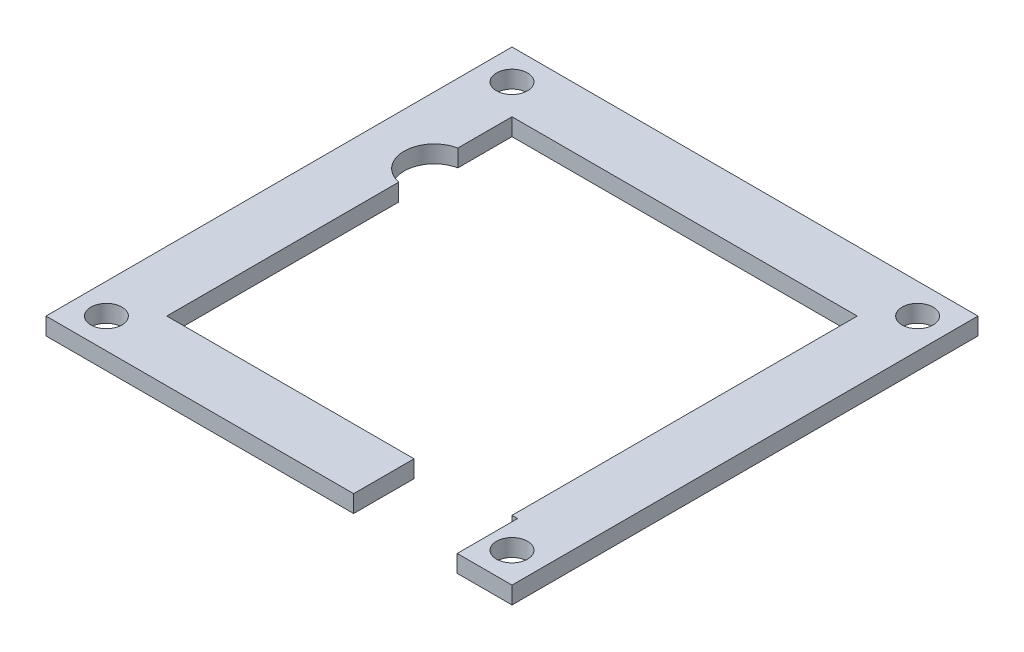
ISO-10303-21;
HEADER;
FILE_DESCRIPTION(('STEP AP214'),'2;1');
FILE_NAME('part.step','',(''),(''),'','','');
FILE_SCHEMA(('AUTOMOTIVE_DESIGN { 1 0 10303 214 1 1 1 1 }'));
ENDSEC;
DATA;
#1=APPLICATION_CONTEXT('core data for automotive mechanical design processes');
#2=APPLICATION_PROTOCOL_DEFINITION('international standard','automotive_design',2000,#1);
#3=PRODUCT_CONTEXT('',#1,'mechanical');
#4=PRODUCT('Part','Part','',(#3));
#5=PRODUCT_RELATED_PRODUCT_CATEGORY('part','',(#4));
#6=PRODUCT_DEFINITION_FORMATION('','',#4);
#7=PRODUCT_DEFINITION_CONTEXT('part definition',#1,'design');
#8=PRODUCT_DEFINITION('design','',#6,#7);
#9=PRODUCT_DEFINITION_SHAPE('','',#8);
#10=(LENGTH_UNIT() NAMED_UNIT(*) SI_UNIT(.MILLI.,.METRE.));
#11=(NAMED_UNIT(*) PLANE_ANGLE_UNIT() SI_UNIT($,.RADIAN.));
#12=(NAMED_UNIT(*) SI_UNIT($,.STERADIAN.) SOLID_ANGLE_UNIT());
#13=UNCERTAINTY_MEASURE_WITH_UNIT(LENGTH_MEASURE(1.E-05),#10,'distance_accuracy_value','');
#14=(GEOMETRIC_REPRESENTATION_CONTEXT(3) GLOBAL_UNCERTAINTY_ASSIGNED_CONTEXT((#13)) GLOBAL_UNIT_ASSIGNED_CONTEXT((#10,
#11,#12)) REPRESENTATION_CONTEXT('',''));
#15=CARTESIAN_POINT('',(0.,0.,0.));
#16=DIRECTION('',(0.,0.,1.));
#17=DIRECTION('',(1.,0.,0.));
#18=AXIS2_PLACEMENT_3D('',#15,#16,#17);
#19=CARTESIAN_POINT('',(-19.3,2.,-10.3));
#20=DIRECTION('',(0.,-1.,0.));
#21=DIRECTION('',(0.,0.,-1.));
#22=AXIS2_PLACEMENT_3D('',#19,#20,#21);
#23=CYLINDRICAL_SURFACE('',#22,3.5);
#24=CARTESIAN_POINT('',(-19.3,0.,-10.3));
#25=DIRECTION('',(0.,1.,0.));
#26=DIRECTION('',(0.,0.,1.));
#27=AXIS2_PLACEMENT_3D('',#24,#25,#26);
#28=CIRCLE('',#27,3.5);
#29=CARTESIAN_POINT('',(-20.,0.,-13.7292856398964));
#30=VERTEX_POINT('',#29);
#31=CARTESIAN_POINT('',(-20.,0.,-6.87071436010355));
#32=VERTEX_POINT('',#31);
#33=EDGE_CURVE('E177',#30,#32,#28,.T.);
#34=ORIENTED_EDGE('',*,*,#33,.F.);
#35=DIRECTION('',(0.,-1.,0.));
#36=VECTOR('',#35,1.);
#37=CARTESIAN_POINT('',(-20.,2.,-13.7292856398964));
#38=LINE('',#37,#36);
#39=CARTESIAN_POINT('',(-20.,2.,-13.7292856398964));
#40=VERTEX_POINT('',#39);
#41=EDGE_CURVE('E11',#40,#30,#38,.T.);
#42=ORIENTED_EDGE('',*,*,#41,.F.);
#43=CARTESIAN_POINT('',(-19.3,2.,-10.3));
#44=DIRECTION('',(0.,1.,0.));
#45=DIRECTION('',(0.,0.,1.));
#46=AXIS2_PLACEMENT_3D('',#43,#44,#45);
#47=CIRCLE('',#46,3.5);
#48=CARTESIAN_POINT('',(-20.,2.,-6.87071436010355));
#49=VERTEX_POINT('',#48);
#50=EDGE_CURVE('E218',#40,#49,#47,.T.);
#51=ORIENTED_EDGE('',*,*,#50,.T.);
#52=DIRECTION('',(0.,-1.,0.));
#53=VECTOR('',#52,1.);
#54=CARTESIAN_POINT('',(-20.,2.,-6.87071436010355));
#55=LINE('',#54,#53);
#56=EDGE_CURVE('E51',#49,#32,#55,.T.);
#57=ORIENTED_EDGE('',*,*,#56,.T.);
#58=EDGE_LOOP('',(#34,#42,#51,#57));
#59=FACE_BOUND('',#58,.T.);
#60=ADVANCED_FACE('F35',(#59),#23,.F.);
#61=CARTESIAN_POINT('',(-20.,2.,0.));
#62=DIRECTION('',(1.,0.,0.));
#63=DIRECTION('',(0.,0.,-1.));
#64=AXIS2_PLACEMENT_3D('',#61,#62,#63);
#65=PLANE('',#64);
#66=DIRECTION('',(0.,0.,1.));
#67=VECTOR('',#66,1.);
#68=CARTESIAN_POINT('',(-20.,0.,0.));
#69=LINE('',#68,#67);
#70=CARTESIAN_POINT('',(-20.,0.,-20.));
#71=VERTEX_POINT('',#70);
#72=EDGE_CURVE('E179',#71,#30,#69,.T.);
#73=ORIENTED_EDGE('',*,*,#72,.F.);
#74=DIRECTION('',(0.,-1.,0.));
#75=VECTOR('',#74,1.);
#76=CARTESIAN_POINT('',(-20.,2.,-20.));
#77=LINE('',#76,#75);
#78=CARTESIAN_POINT('',(-20.,2.,-20.));
#79=VERTEX_POINT('',#78);
#80=EDGE_CURVE('E43',#79,#71,#77,.T.);
#81=ORIENTED_EDGE('',*,*,#80,.F.);
#82=DIRECTION('',(0.,0.,1.));
#83=VECTOR('',#82,1.);
#84=CARTESIAN_POINT('',(-20.,2.,0.));
#85=LINE('',#84,#83);
#86=EDGE_CURVE('E163',#79,#40,#85,.T.);
#87=ORIENTED_EDGE('',*,*,#86,.T.);
#88=ORIENTED_EDGE('',*,*,#41,.T.);
#89=EDGE_LOOP('',(#73,#81,#87,#88));
#90=FACE_BOUND('',#89,.T.);
#91=ADVANCED_FACE('F256',(#90),#65,.T.);
#92=CARTESIAN_POINT('',(0.,2.,-20.));
#93=DIRECTION('',(0.,0.,-1.));
#94=DIRECTION('',(-1.,0.,0.));
#95=AXIS2_PLACEMENT_3D('',#92,#93,#94);
#96=PLANE('',#95);
#97=DIRECTION('',(1.,0.,0.));
#98=VECTOR('',#97,1.);
#99=CARTESIAN_POINT('',(0.,0.,-20.));
#100=LINE('',#99,#98);
#101=CARTESIAN_POINT('',(20.,0.,-20.));
#102=VERTEX_POINT('',#101);
#103=EDGE_CURVE('E182',#71,#102,#100,.T.);
#104=ORIENTED_EDGE('',*,*,#103,.T.);
#105=DIRECTION('',(0.,-1.,0.));
#106=VECTOR('',#105,1.);
#107=CARTESIAN_POINT('',(20.,2.,-20.));
#108=LINE('',#107,#106);
#109=CARTESIAN_POINT('',(20.,2.,-20.));
#110=VERTEX_POINT('',#109);
#111=EDGE_CURVE('E241',#110,#102,#108,.T.);
#112=ORIENTED_EDGE('',*,*,#111,.F.);
#113=DIRECTION('',(1.,0.,0.));
#114=VECTOR('',#113,1.);
#115=CARTESIAN_POINT('',(0.,2.,-20.));
#116=LINE('',#115,#114);
#117=EDGE_CURVE('E247',#79,#110,#116,.T.);
#118=ORIENTED_EDGE('',*,*,#117,.F.);
#119=ORIENTED_EDGE('',*,*,#80,.T.);
#120=EDGE_LOOP('',(#104,#112,#118,#119));
#121=FACE_BOUND('',#120,.T.);
#122=ADVANCED_FACE('F245',(#121),#96,.F.);
#123=CARTESIAN_POINT('',(20.,2.,0.));
#124=DIRECTION('',(-1.,0.,0.));
#125=DIRECTION('',(0.,0.,1.));
#126=AXIS2_PLACEMENT_3D('',#123,#124,#125);
#127=PLANE('',#126);
#128=DIRECTION('',(0.,0.,-1.));
#129=VECTOR('',#128,1.);
#130=CARTESIAN_POINT('',(20.,0.,0.));
#131=LINE('',#130,#129);
#132=CARTESIAN_POINT('',(20.,0.,20.));
#133=VERTEX_POINT('',#132);
#134=EDGE_CURVE('E186',#133,#102,#131,.T.);
#135=ORIENTED_EDGE('',*,*,#134,.F.);
#136=DIRECTION('',(0.,-1.,0.));
#137=VECTOR('',#136,1.);
#138=CARTESIAN_POINT('',(20.,2.,20.));
#139=LINE('',#138,#137);
#140=CARTESIAN_POINT('',(20.,2.,20.));
#141=VERTEX_POINT('',#140);
#142=EDGE_CURVE('E239',#141,#133,#139,.T.);
#143=ORIENTED_EDGE('',*,*,#142,.F.);
#144=DIRECTION('',(0.,0.,-1.));
#145=VECTOR('',#144,1.);
#146=CARTESIAN_POINT('',(20.,2.,0.));
#147=LINE('',#146,#145);
#148=EDGE_CURVE('E494',#141,#110,#147,.T.);
#149=ORIENTED_EDGE('',*,*,#148,.T.);
#150=ORIENTED_EDGE('',*,*,#111,.T.);
#151=EDGE_LOOP('',(#135,#143,#149,#150));
#152=FACE_BOUND('',#151,.T.);
#153=ADVANCED_FACE('F287',(#152),#127,.T.);
#154=CARTESIAN_POINT('',(2.13504427812533E-13,2.,20.0000000000002));
#155=DIRECTION('',(0.,0.,1.));
#156=DIRECTION('',(1.,0.,0.));
#157=AXIS2_PLACEMENT_3D('',#154,#155,#156);
#158=PLANE('',#157);
#159=DIRECTION('',(-1.,0.,0.));
#160=VECTOR('',#159,1.);
#161=CARTESIAN_POINT('',(2.13504427812533E-13,0.,20.0000000000002));
#162=LINE('',#161,#160);
#163=CARTESIAN_POINT('',(20.65,0.,20.));
#164=VERTEX_POINT('',#163);
#165=EDGE_CURVE('E189',#164,#133,#162,.T.);
#166=ORIENTED_EDGE('',*,*,#165,.F.);
#167=DIRECTION('',(0.,-1.,0.));
#168=VECTOR('',#167,1.);
#169=CARTESIAN_POINT('',(20.65,2.,20.));
#170=LINE('',#169,#168);
#171=CARTESIAN_POINT('',(20.65,2.,20.));
#172=VERTEX_POINT('',#171);
#173=EDGE_CURVE('E237',#172,#164,#170,.T.);
#174=ORIENTED_EDGE('',*,*,#173,.F.);
#175=DIRECTION('',(-1.,0.,0.));
#176=VECTOR('',#175,1.);
#177=CARTESIAN_POINT('',(2.13504427812533E-13,2.,20.0000000000002));
#178=LINE('',#177,#176);
#179=EDGE_CURVE('E491',#172,#141,#178,.T.);
#180=ORIENTED_EDGE('',*,*,#179,.T.);
#181=ORIENTED_EDGE('',*,*,#142,.T.);
#182=EDGE_LOOP('',(#166,#174,#180,#181));
#183=FACE_BOUND('',#182,.T.);
#184=ADVANCED_FACE('F293',(#183),#158,.T.);
#185=CARTESIAN_POINT('',(20.65,2.,0.));
#186=DIRECTION('',(1.,0.,0.));
#187=DIRECTION('',(0.,0.,-1.));
#188=AXIS2_PLACEMENT_3D('',#185,#186,#187);
#189=PLANE('',#188);
#190=DIRECTION('',(0.,0.,1.));
#191=VECTOR('',#190,1.);
#192=CARTESIAN_POINT('',(20.65,0.,0.));
#193=LINE('',#192,#191);
#194=CARTESIAN_POINT('',(20.65,0.,27.));
#195=VERTEX_POINT('',#194);
#196=EDGE_CURVE('E192',#164,#195,#193,.T.);
#197=ORIENTED_EDGE('',*,*,#196,.T.);
#198=DIRECTION('',(0.,-1.,0.));
#199=VECTOR('',#198,1.);
#200=CARTESIAN_POINT('',(20.65,2.,27.));
#201=LINE('',#200,#199);
#202=CARTESIAN_POINT('',(20.65,2.,27.));
#203=VERTEX_POINT('',#202);
#204=EDGE_CURVE('E234',#203,#195,#201,.T.);
#205=ORIENTED_EDGE('',*,*,#204,.F.);
#206=DIRECTION('',(0.,0.,1.));
#207=VECTOR('',#206,1.);
#208=CARTESIAN_POINT('',(20.65,2.,0.));
#209=LINE('',#208,#207);
#210=EDGE_CURVE('E488',#172,#203,#209,.T.);
#211=ORIENTED_EDGE('',*,*,#210,.F.);
#212=ORIENTED_EDGE('',*,*,#173,.T.);
#213=EDGE_LOOP('',(#197,#205,#211,#212));
#214=FACE_BOUND('',#213,.T.);
#215=ADVANCED_FACE('F301',(#214),#189,.F.);
#216=CARTESIAN_POINT('',(0.,2.,27.));
#217=DIRECTION('',(0.,0.,-1.));
#218=DIRECTION('',(-1.,0.,0.));
#219=AXIS2_PLACEMENT_3D('',#216,#217,#218);
#220=PLANE('',#219);
#221=DIRECTION('',(1.,0.,0.));
#222=VECTOR('',#221,1.);
#223=CARTESIAN_POINT('',(0.,0.,27.));
#224=LINE('',#223,#222);
#225=CARTESIAN_POINT('',(27.,0.,27.));
#226=VERTEX_POINT('',#225);
#227=EDGE_CURVE('E194',#195,#226,#224,.T.);
#228=ORIENTED_EDGE('',*,*,#227,.T.);
#229=DIRECTION('',(0.,-1.,0.));
#230=VECTOR('',#229,1.);
#231=CARTESIAN_POINT('',(27.,2.,27.));
#232=LINE('',#231,#230);
#233=CARTESIAN_POINT('',(27.,2.,27.));
#234=VERTEX_POINT('',#233);
#235=EDGE_CURVE('E231',#234,#226,#232,.T.);
#236=ORIENTED_EDGE('',*,*,#235,.F.);
#237=DIRECTION('',(1.,0.,0.));
#238=VECTOR('',#237,1.);
#239=CARTESIAN_POINT('',(0.,2.,27.));
#240=LINE('',#239,#238);
#241=EDGE_CURVE('E486',#203,#234,#240,.T.);
#242=ORIENTED_EDGE('',*,*,#241,.F.);
#243=ORIENTED_EDGE('',*,*,#204,.T.);
#244=EDGE_LOOP('',(#228,#236,#242,#243));
#245=FACE_BOUND('',#244,.T.);
#246=ADVANCED_FACE('F309',(#245),#220,.F.);
#247=CARTESIAN_POINT('',(27.,2.,0.));
#248=DIRECTION('',(-1.,0.,0.));
#249=DIRECTION('',(0.,0.,1.));
#250=AXIS2_PLACEMENT_3D('',#247,#248,#249);
#251=PLANE('',#250);
#252=DIRECTION('',(0.,0.,-1.));
#253=VECTOR('',#252,1.);
#254=CARTESIAN_POINT('',(27.,0.,0.));
#255=LINE('',#254,#253);
#256=CARTESIAN_POINT('',(27.,0.,-27.));
#257=VERTEX_POINT('',#256);
#258=EDGE_CURVE('E196',#226,#257,#255,.T.);
#259=ORIENTED_EDGE('',*,*,#258,.T.);
#260=DIRECTION('',(0.,-1.,0.));
#261=VECTOR('',#260,1.);
#262=CARTESIAN_POINT('',(27.,2.,-27.));
#263=LINE('',#262,#261);
#264=CARTESIAN_POINT('',(27.,2.,-27.));
#265=VERTEX_POINT('',#264);
#266=EDGE_CURVE('E228',#265,#257,#263,.T.);
#267=ORIENTED_EDGE('',*,*,#266,.F.);
#268=DIRECTION('',(0.,0.,-1.));
#269=VECTOR('',#268,1.);
#270=CARTESIAN_POINT('',(27.,2.,0.));
#271=LINE('',#270,#269);
#272=EDGE_CURVE('E479',#234,#265,#271,.T.);
#273=ORIENTED_EDGE('',*,*,#272,.F.);
#274=ORIENTED_EDGE('',*,*,#235,.T.);
#275=EDGE_LOOP('',(#259,#267,#273,#274));
#276=FACE_BOUND('',#275,.T.);
#277=ADVANCED_FACE('F317',(#276),#251,.F.);
#278=CARTESIAN_POINT('',(0.,2.,-27.));
#279=DIRECTION('',(0.,0.,1.));
#280=DIRECTION('',(1.,0.,0.));
#281=AXIS2_PLACEMENT_3D('',#278,#279,#280);
#282=PLANE('',#281);
#283=DIRECTION('',(-1.,0.,0.));
#284=VECTOR('',#283,1.);
#285=CARTESIAN_POINT('',(0.,0.,-27.));
#286=LINE('',#285,#284);
#287=CARTESIAN_POINT('',(-27.,0.,-27.));
#288=VERTEX_POINT('',#287);
#289=EDGE_CURVE('E199',#257,#288,#286,.T.);
#290=ORIENTED_EDGE('',*,*,#289,.T.);
#291=DIRECTION('',(0.,-1.,0.));
#292=VECTOR('',#291,1.);
#293=CARTESIAN_POINT('',(-27.,2.,-27.));
#294=LINE('',#293,#292);
#295=CARTESIAN_POINT('',(-27.,2.,-27.));
#296=VERTEX_POINT('',#295);
#297=EDGE_CURVE('E225',#296,#288,#294,.T.);
#298=ORIENTED_EDGE('',*,*,#297,.F.);
#299=DIRECTION('',(-1.,0.,0.));
#300=VECTOR('',#299,1.);
#301=CARTESIAN_POINT('',(0.,2.,-27.));
#302=LINE('',#301,#300);
#303=EDGE_CURVE('E476',#265,#296,#302,.T.);
#304=ORIENTED_EDGE('',*,*,#303,.F.);
#305=ORIENTED_EDGE('',*,*,#266,.T.);
#306=EDGE_LOOP('',(#290,#298,#304,#305));
#307=FACE_BOUND('',#306,.T.);
#308=ADVANCED_FACE('F326',(#307),#282,.F.);
#309=CARTESIAN_POINT('',(-27.,2.,0.));
#310=DIRECTION('',(1.,0.,0.));
#311=DIRECTION('',(0.,0.,-1.));
#312=AXIS2_PLACEMENT_3D('',#309,#310,#311);
#313=PLANE('',#312);
#314=DIRECTION('',(0.,0.,1.));
#315=VECTOR('',#314,1.);
#316=CARTESIAN_POINT('',(-27.,0.,0.));
#317=LINE('',#316,#315);
#318=CARTESIAN_POINT('',(-27.,0.,27.));
#319=VERTEX_POINT('',#318);
#320=EDGE_CURVE('E201',#288,#319,#317,.T.);
#321=ORIENTED_EDGE('',*,*,#320,.T.);
#322=DIRECTION('',(0.,-1.,0.));
#323=VECTOR('',#322,1.);
#324=CARTESIAN_POINT('',(-27.,2.,27.));
#325=LINE('',#324,#323);
#326=CARTESIAN_POINT('',(-27.,2.,27.));
#327=VERTEX_POINT('',#326);
#328=EDGE_CURVE('E222',#327,#319,#325,.T.);
#329=ORIENTED_EDGE('',*,*,#328,.F.);
#330=DIRECTION('',(0.,0.,1.));
#331=VECTOR('',#330,1.);
#332=CARTESIAN_POINT('',(-27.,2.,0.));
#333=LINE('',#332,#331);
#334=EDGE_CURVE('E474',#296,#327,#333,.T.);
#335=ORIENTED_EDGE('',*,*,#334,.F.);
#336=ORIENTED_EDGE('',*,*,#297,.T.);
#337=EDGE_LOOP('',(#321,#329,#335,#336));
#338=FACE_BOUND('',#337,.T.);
#339=ADVANCED_FACE('F334',(#338),#313,.F.);
#340=CARTESIAN_POINT('',(8.65,0.,27.));
#341=VERTEX_POINT('',#340);
#342=EDGE_CURVE('E197',#319,#341,#224,.T.);
#343=ORIENTED_EDGE('',*,*,#342,.T.);
#344=DIRECTION('',(0.,-1.,0.));
#345=VECTOR('',#344,1.);
#346=CARTESIAN_POINT('',(8.65,2.,27.));
#347=LINE('',#346,#345);
#348=CARTESIAN_POINT('',(8.65,2.,27.));
#349=VERTEX_POINT('',#348);
#350=EDGE_CURVE('E146',#349,#341,#347,.T.);
#351=ORIENTED_EDGE('',*,*,#350,.F.);
#352=EDGE_CURVE('E155',#327,#349,#240,.T.);
#353=ORIENTED_EDGE('',*,*,#352,.F.);
#354=ORIENTED_EDGE('',*,*,#328,.T.);
#355=EDGE_LOOP('',(#343,#351,#353,#354));
#356=FACE_BOUND('',#355,.T.);
#357=ADVANCED_FACE('F320',(#356),#220,.F.);
#358=CARTESIAN_POINT('',(8.65,2.,0.));
#359=DIRECTION('',(1.,0.,0.));
#360=DIRECTION('',(0.,0.,-1.));
#361=AXIS2_PLACEMENT_3D('',#358,#359,#360);
#362=PLANE('',#361);
#363=DIRECTION('',(0.,0.,1.));
#364=VECTOR('',#363,1.);
#365=CARTESIAN_POINT('',(8.65,0.,0.));
#366=LINE('',#365,#364);
#367=CARTESIAN_POINT('',(8.65,0.,20.));
#368=VERTEX_POINT('',#367);
#369=EDGE_CURVE('E142',#368,#341,#366,.T.);
#370=ORIENTED_EDGE('',*,*,#369,.F.);
#371=DIRECTION('',(0.,-1.,0.));
#372=VECTOR('',#371,1.);
#373=CARTESIAN_POINT('',(8.65,2.,20.));
#374=LINE('',#373,#372);
#375=CARTESIAN_POINT('',(8.65,2.,20.));
#376=VERTEX_POINT('',#375);
#377=EDGE_CURVE('E137',#376,#368,#374,.T.);
#378=ORIENTED_EDGE('',*,*,#377,.F.);
#379=DIRECTION('',(0.,0.,1.));
#380=VECTOR('',#379,1.);
#381=CARTESIAN_POINT('',(8.65,2.,0.));
#382=LINE('',#381,#380);
#383=EDGE_CURVE('E140',#376,#349,#382,.T.);
#384=ORIENTED_EDGE('',*,*,#383,.T.);
#385=ORIENTED_EDGE('',*,*,#350,.T.);
#386=EDGE_LOOP('',(#370,#378,#384,#385));
#387=FACE_BOUND('',#386,.T.);
#388=ADVANCED_FACE('F139',(#387),#362,.T.);
#389=CARTESIAN_POINT('',(0.,2.,20.));
#390=DIRECTION('',(0.,0.,-1.));
#391=DIRECTION('',(-1.,0.,0.));
#392=AXIS2_PLACEMENT_3D('',#389,#390,#391);
#393=PLANE('',#392);
#394=DIRECTION('',(1.,0.,0.));
#395=VECTOR('',#394,1.);
#396=CARTESIAN_POINT('',(0.,0.,20.));
#397=LINE('',#396,#395);
#398=CARTESIAN_POINT('',(-20.,0.,20.));
#399=VERTEX_POINT('',#398);
#400=EDGE_CURVE('E204',#399,#368,#397,.T.);
#401=ORIENTED_EDGE('',*,*,#400,.F.);
#402=DIRECTION('',(0.,-1.,0.));
#403=VECTOR('',#402,1.);
#404=CARTESIAN_POINT('',(-20.,2.,20.));
#405=LINE('',#404,#403);
#406=CARTESIAN_POINT('',(-20.,2.,20.));
#407=VERTEX_POINT('',#406);
#408=EDGE_CURVE('E94',#407,#399,#405,.T.);
#409=ORIENTED_EDGE('',*,*,#408,.F.);
#410=DIRECTION('',(1.,0.,0.));
#411=VECTOR('',#410,1.);
#412=CARTESIAN_POINT('',(0.,2.,20.));
#413=LINE('',#412,#411);
#414=EDGE_CURVE('E153',#407,#376,#413,.T.);
#415=ORIENTED_EDGE('',*,*,#414,.T.);
#416=ORIENTED_EDGE('',*,*,#377,.T.);
#417=EDGE_LOOP('',(#401,#409,#415,#416));
#418=FACE_BOUND('',#417,.T.);
#419=ADVANCED_FACE('F158',(#418),#393,.T.);
#420=CARTESIAN_POINT('',(23.5,2.,23.5));
#421=DIRECTION('',(0.,-1.,0.));
#422=DIRECTION('',(0.,0.,-1.));
#423=AXIS2_PLACEMENT_3D('',#420,#421,#422);
#424=CYLINDRICAL_SURFACE('',#423,1.8);
#425=CARTESIAN_POINT('',(23.5,2.,23.5));
#426=DIRECTION('',(0.,1.,0.));
#427=DIRECTION('',(0.,0.,1.));
#428=AXIS2_PLACEMENT_3D('',#425,#426,#427);
#429=CIRCLE('',#428,1.8);
#430=CARTESIAN_POINT('',(23.5,2.,25.3));
#431=VERTEX_POINT('',#430);
#432=EDGE_CURVE('E171',#431,#431,#429,.T.);
#433=ORIENTED_EDGE('',*,*,#432,.T.);
#434=EDGE_LOOP('',(#433));
#435=FACE_BOUND('',#434,.T.);
#436=CARTESIAN_POINT('',(23.5,0.,23.5));
#437=DIRECTION('',(0.,1.,0.));
#438=DIRECTION('',(0.,0.,1.));
#439=AXIS2_PLACEMENT_3D('',#436,#437,#438);
#440=CIRCLE('',#439,1.8);
#441=CARTESIAN_POINT('',(23.5,0.,25.3));
#442=VERTEX_POINT('',#441);
#443=EDGE_CURVE('E212',#442,#442,#440,.T.);
#444=ORIENTED_EDGE('',*,*,#443,.F.);
#445=EDGE_LOOP('',(#444));
#446=FACE_BOUND('',#445,.T.);
#447=ADVANCED_FACE('F361',(#435,#446),#424,.F.);
#448=CARTESIAN_POINT('',(-23.5,2.,-23.5));
#449=DIRECTION('',(0.,-1.,0.));
#450=DIRECTION('',(0.,0.,-1.));
#451=AXIS2_PLACEMENT_3D('',#448,#449,#450);
#452=CYLINDRICAL_SURFACE('',#451,1.8);
#453=CARTESIAN_POINT('',(-23.5,2.,-23.5));
#454=DIRECTION('',(0.,1.,0.));
#455=DIRECTION('',(0.,0.,1.));
#456=AXIS2_PLACEMENT_3D('',#453,#454,#455);
#457=CIRCLE('',#456,1.8);
#458=CARTESIAN_POINT('',(-23.5,2.,-21.7));
#459=VERTEX_POINT('',#458);
#460=EDGE_CURVE('E168',#459,#459,#457,.T.);
#461=ORIENTED_EDGE('',*,*,#460,.T.);
#462=EDGE_LOOP('',(#461));
#463=FACE_BOUND('',#462,.T.);
#464=CARTESIAN_POINT('',(-23.5,0.,-23.5));
#465=DIRECTION('',(0.,1.,0.));
#466=DIRECTION('',(0.,0.,1.));
#467=AXIS2_PLACEMENT_3D('',#464,#465,#466);
#468=CIRCLE('',#467,1.8);
#469=CARTESIAN_POINT('',(-23.5,0.,-21.7));
#470=VERTEX_POINT('',#469);
#471=EDGE_CURVE('E209',#470,#470,#468,.T.);
#472=ORIENTED_EDGE('',*,*,#471,.F.);
#473=EDGE_LOOP('',(#472));
#474=FACE_BOUND('',#473,.T.);
#475=ADVANCED_FACE('F269',(#463,#474),#452,.F.);
#476=CARTESIAN_POINT('',(23.5,2.,-23.5));
#477=DIRECTION('',(0.,-1.,0.));
#478=DIRECTION('',(0.,0.,-1.));
#479=AXIS2_PLACEMENT_3D('',#476,#477,#478);
#480=CYLINDRICAL_SURFACE('',#479,1.8);
#481=CARTESIAN_POINT('',(23.5,2.,-23.5));
#482=DIRECTION('',(0.,1.,0.));
#483=DIRECTION('',(0.,0.,1.));
#484=AXIS2_PLACEMENT_3D('',#481,#482,#483);
#485=CIRCLE('',#484,1.8);
#486=CARTESIAN_POINT('',(23.5,2.,-21.7));
#487=VERTEX_POINT('',#486);
#488=EDGE_CURVE('E161',#487,#487,#485,.T.);
#489=ORIENTED_EDGE('',*,*,#488,.T.);
#490=EDGE_LOOP('',(#489));
#491=FACE_BOUND('',#490,.T.);
#492=CARTESIAN_POINT('',(23.5,0.,-23.5));
#493=DIRECTION('',(0.,1.,0.));
#494=DIRECTION('',(0.,0.,1.));
#495=AXIS2_PLACEMENT_3D('',#492,#493,#494);
#496=CIRCLE('',#495,1.8);
#497=CARTESIAN_POINT('',(23.5,0.,-21.7));
#498=VERTEX_POINT('',#497);
#499=EDGE_CURVE('E206',#498,#498,#496,.T.);
#500=ORIENTED_EDGE('',*,*,#499,.F.);
#501=EDGE_LOOP('',(#500));
#502=FACE_BOUND('',#501,.T.);
#503=ADVANCED_FACE('F261',(#491,#502),#480,.F.);
#504=EDGE_CURVE('E183',#32,#399,#69,.T.);
#505=ORIENTED_EDGE('',*,*,#504,.F.);
#506=ORIENTED_EDGE('',*,*,#56,.F.);
#507=EDGE_CURVE('E159',#49,#407,#85,.T.);
#508=ORIENTED_EDGE('',*,*,#507,.T.);
#509=ORIENTED_EDGE('',*,*,#408,.T.);
#510=EDGE_LOOP('',(#505,#506,#508,#509));
#511=FACE_BOUND('',#510,.T.);
#512=ADVANCED_FACE('F258',(#511),#65,.T.);
#513=CARTESIAN_POINT('',(-23.5,2.,23.5));
#514=DIRECTION('',(0.,-1.,0.));
#515=DIRECTION('',(0.,0.,-1.));
#516=AXIS2_PLACEMENT_3D('',#513,#514,#515);
#517=CYLINDRICAL_SURFACE('',#516,1.8);
#518=CARTESIAN_POINT('',(-23.5,2.,23.5));
#519=DIRECTION('',(0.,1.,0.));
#520=DIRECTION('',(0.,0.,1.));
#521=AXIS2_PLACEMENT_3D('',#518,#519,#520);
#522=CIRCLE('',#521,1.8);
#523=CARTESIAN_POINT('',(-23.5,2.,25.3));
#524=VERTEX_POINT('',#523);
#525=EDGE_CURVE('E174',#524,#524,#522,.T.);
#526=ORIENTED_EDGE('',*,*,#525,.T.);
#527=EDGE_LOOP('',(#526));
#528=FACE_BOUND('',#527,.T.);
#529=CARTESIAN_POINT('',(-23.5,0.,23.5));
#530=DIRECTION('',(0.,1.,0.));
#531=DIRECTION('',(0.,0.,1.));
#532=AXIS2_PLACEMENT_3D('',#529,#530,#531);
#533=CIRCLE('',#532,1.8);
#534=CARTESIAN_POINT('',(-23.5,0.,25.3));
#535=VERTEX_POINT('',#534);
#536=EDGE_CURVE('E215',#535,#535,#533,.T.);
#537=ORIENTED_EDGE('',*,*,#536,.F.);
#538=EDGE_LOOP('',(#537));
#539=FACE_BOUND('',#538,.T.);
#540=ADVANCED_FACE('F260',(#528,#539),#517,.F.);
#541=CARTESIAN_POINT('',(0.,2.,0.));
#542=DIRECTION('',(0.,1.,0.));
#543=DIRECTION('',(0.,0.,1.));
#544=AXIS2_PLACEMENT_3D('',#541,#542,#543);
#545=PLANE('',#544);
#546=ORIENTED_EDGE('',*,*,#50,.F.);
#547=ORIENTED_EDGE('',*,*,#86,.F.);
#548=ORIENTED_EDGE('',*,*,#117,.T.);
#549=ORIENTED_EDGE('',*,*,#148,.F.);
#550=ORIENTED_EDGE('',*,*,#179,.F.);
#551=ORIENTED_EDGE('',*,*,#210,.T.);
#552=ORIENTED_EDGE('',*,*,#241,.T.);
#553=ORIENTED_EDGE('',*,*,#272,.T.);
#554=ORIENTED_EDGE('',*,*,#303,.T.);
#555=ORIENTED_EDGE('',*,*,#334,.T.);
#556=ORIENTED_EDGE('',*,*,#352,.T.);
#557=ORIENTED_EDGE('',*,*,#383,.F.);
#558=ORIENTED_EDGE('',*,*,#414,.F.);
#559=ORIENTED_EDGE('',*,*,#507,.F.);
#560=EDGE_LOOP('',(#546,#547,#548,#549,#550,#551,#552,#553,#554,#555,#556,#557,#558,#559));
#561=FACE_BOUND('',#560,.T.);
#562=ORIENTED_EDGE('',*,*,#488,.F.);
#563=EDGE_LOOP('',(#562));
#564=FACE_BOUND('',#563,.T.);
#565=ORIENTED_EDGE('',*,*,#460,.F.);
#566=EDGE_LOOP('',(#565));
#567=FACE_BOUND('',#566,.T.);
#568=ORIENTED_EDGE('',*,*,#432,.F.);
#569=EDGE_LOOP('',(#568));
#570=FACE_BOUND('',#569,.T.);
#571=ORIENTED_EDGE('',*,*,#525,.F.);
#572=EDGE_LOOP('',(#571));
#573=FACE_BOUND('',#572,.T.);
#574=ADVANCED_FACE('F150',(#561,#564,#567,#570,#573),#545,.T.);
#575=CARTESIAN_POINT('',(0.,0.,0.));
#576=DIRECTION('',(0.,1.,0.));
#577=DIRECTION('',(0.,0.,1.));
#578=AXIS2_PLACEMENT_3D('',#575,#576,#577);
#579=PLANE('',#578);
#580=ORIENTED_EDGE('',*,*,#33,.T.);
#581=ORIENTED_EDGE('',*,*,#504,.T.);
#582=ORIENTED_EDGE('',*,*,#400,.T.);
#583=ORIENTED_EDGE('',*,*,#369,.T.);
#584=ORIENTED_EDGE('',*,*,#342,.F.);
#585=ORIENTED_EDGE('',*,*,#320,.F.);
#586=ORIENTED_EDGE('',*,*,#289,.F.);
#587=ORIENTED_EDGE('',*,*,#258,.F.);
#588=ORIENTED_EDGE('',*,*,#227,.F.);
#589=ORIENTED_EDGE('',*,*,#196,.F.);
#590=ORIENTED_EDGE('',*,*,#165,.T.);
#591=ORIENTED_EDGE('',*,*,#134,.T.);
#592=ORIENTED_EDGE('',*,*,#103,.F.);
#593=ORIENTED_EDGE('',*,*,#72,.T.);
#594=EDGE_LOOP('',(#580,#581,#582,#583,#584,#585,#586,#587,#588,#589,#590,#591,#592,#593));
#595=FACE_BOUND('',#594,.T.);
#596=ORIENTED_EDGE('',*,*,#499,.T.);
#597=EDGE_LOOP('',(#596));
#598=FACE_BOUND('',#597,.T.);
#599=ORIENTED_EDGE('',*,*,#471,.T.);
#600=EDGE_LOOP('',(#599));
#601=FACE_BOUND('',#600,.T.);
#602=ORIENTED_EDGE('',*,*,#443,.T.);
#603=EDGE_LOOP('',(#602));
#604=FACE_BOUND('',#603,.T.);
#605=ORIENTED_EDGE('',*,*,#536,.T.);
#606=EDGE_LOOP('',(#605));
#607=FACE_BOUND('',#606,.T.);
#608=ADVANCED_FACE('F253',(#595,#598,#601,#604,#607),#579,.F.);
#609=CLOSED_SHELL('',(#60,#91,#122,#153,#184,#215,#246,#277,#308,#339,#357,#388,#419,#447,#475,
#503,#512,#540,#574,#608));
#610=MANIFOLD_SOLID_BREP('B2',#609);
#611=ADVANCED_BREP_SHAPE_REPRESENTATION('',(#18,#610),#14);
#612=SHAPE_DEFINITION_REPRESENTATION(#9,#611);
ENDSEC;
END-ISO-10303-21;
